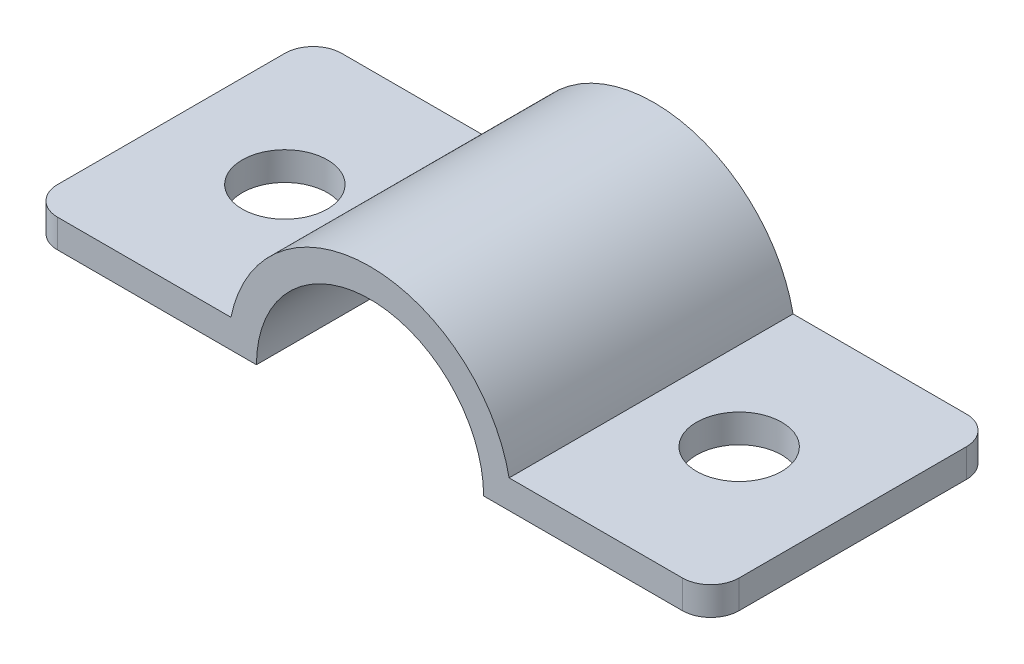
ISO-10303-21;
HEADER;
FILE_DESCRIPTION(('STEP AP214'),'2;1');
FILE_NAME('part.step','',(''),(''),'','','');
FILE_SCHEMA(('AUTOMOTIVE_DESIGN { 1 0 10303 214 1 1 1 1 }'));
ENDSEC;
DATA;
#1=APPLICATION_CONTEXT('core data for automotive mechanical design processes');
#2=APPLICATION_PROTOCOL_DEFINITION('international standard','automotive_design',2000,#1);
#3=PRODUCT_CONTEXT('',#1,'mechanical');
#4=PRODUCT('Part','Part','',(#3));
#5=PRODUCT_RELATED_PRODUCT_CATEGORY('part','',(#4));
#6=PRODUCT_DEFINITION_FORMATION('','',#4);
#7=PRODUCT_DEFINITION_CONTEXT('part definition',#1,'design');
#8=PRODUCT_DEFINITION('design','',#6,#7);
#9=PRODUCT_DEFINITION_SHAPE('','',#8);
#10=(LENGTH_UNIT() NAMED_UNIT(*) SI_UNIT(.MILLI.,.METRE.));
#11=(NAMED_UNIT(*) PLANE_ANGLE_UNIT() SI_UNIT($,.RADIAN.));
#12=(NAMED_UNIT(*) SI_UNIT($,.STERADIAN.) SOLID_ANGLE_UNIT());
#13=UNCERTAINTY_MEASURE_WITH_UNIT(LENGTH_MEASURE(1.E-05),#10,'distance_accuracy_value','');
#14=(GEOMETRIC_REPRESENTATION_CONTEXT(3) GLOBAL_UNCERTAINTY_ASSIGNED_CONTEXT((#13)) GLOBAL_UNIT_ASSIGNED_CONTEXT((#10,
#11,#12)) REPRESENTATION_CONTEXT('',''));
#15=CARTESIAN_POINT('',(0.,0.,0.));
#16=DIRECTION('',(0.,0.,1.));
#17=DIRECTION('',(1.,0.,0.));
#18=AXIS2_PLACEMENT_3D('',#15,#16,#17);
#19=CARTESIAN_POINT('',(0.,0.,5.));
#20=DIRECTION('',(0.,0.,-1.));
#21=DIRECTION('',(-1.,0.,0.));
#22=AXIS2_PLACEMENT_3D('',#19,#20,#21);
#23=CYLINDRICAL_SURFACE('',#22,5.);
#24=CARTESIAN_POINT('',(0.,0.,-5.));
#25=DIRECTION('',(0.,0.,1.));
#26=DIRECTION('',(1.,0.,0.));
#27=AXIS2_PLACEMENT_3D('',#24,#25,#26);
#28=CIRCLE('',#27,5.);
#29=CARTESIAN_POINT('',(4.89897948556636,1.,-5.));
#30=VERTEX_POINT('',#29);
#31=CARTESIAN_POINT('',(-4.89897948556636,1.,-5.));
#32=VERTEX_POINT('',#31);
#33=EDGE_CURVE('E159',#30,#32,#28,.T.);
#34=ORIENTED_EDGE('',*,*,#33,.T.);
#35=DIRECTION('',(0.,0.,-1.));
#36=VECTOR('',#35,1.);
#37=CARTESIAN_POINT('',(-4.89897948556636,1.,5.));
#38=LINE('',#37,#36);
#39=CARTESIAN_POINT('',(-4.89897948556636,1.,5.));
#40=VERTEX_POINT('',#39);
#41=EDGE_CURVE('E136',#40,#32,#38,.T.);
#42=ORIENTED_EDGE('',*,*,#41,.F.);
#43=CARTESIAN_POINT('',(0.,0.,5.));
#44=DIRECTION('',(0.,0.,1.));
#45=DIRECTION('',(1.,0.,0.));
#46=AXIS2_PLACEMENT_3D('',#43,#44,#45);
#47=CIRCLE('',#46,5.);
#48=CARTESIAN_POINT('',(4.89897948556636,1.,5.));
#49=VERTEX_POINT('',#48);
#50=EDGE_CURVE('E145',#49,#40,#47,.T.);
#51=ORIENTED_EDGE('',*,*,#50,.F.);
#52=DIRECTION('',(0.,0.,-1.));
#53=VECTOR('',#52,1.);
#54=CARTESIAN_POINT('',(4.89897948556636,1.,5.));
#55=LINE('',#54,#53);
#56=EDGE_CURVE('E233',#49,#30,#55,.T.);
#57=ORIENTED_EDGE('',*,*,#56,.T.);
#58=EDGE_LOOP('',(#34,#42,#51,#57));
#59=FACE_BOUND('',#58,.T.);
#60=ADVANCED_FACE('F39',(#59),#23,.T.);
#61=CARTESIAN_POINT('',(-4.89897948556636,1.,5.));
#62=DIRECTION('',(0.,-1.,0.));
#63=DIRECTION('',(1.,0.,0.));
#64=AXIS2_PLACEMENT_3D('',#61,#62,#63);
#65=PLANE('',#64);
#66=CARTESIAN_POINT('',(-8.,1.,0.));
#67=DIRECTION('',(0.,1.,0.));
#68=DIRECTION('',(0.,0.,1.));
#69=AXIS2_PLACEMENT_3D('',#66,#67,#68);
#70=CIRCLE('',#69,1.5);
#71=CARTESIAN_POINT('',(-8.,1.,1.5));
#72=VERTEX_POINT('',#71);
#73=EDGE_CURVE('E340',#72,#72,#70,.T.);
#74=ORIENTED_EDGE('',*,*,#73,.F.);
#75=EDGE_LOOP('',(#74));
#76=FACE_BOUND('',#75,.T.);
#77=DIRECTION('',(0.,0.,-1.));
#78=VECTOR('',#77,1.);
#79=CARTESIAN_POINT('',(-12.,0.999999999999999,5.));
#80=LINE('',#79,#78);
#81=CARTESIAN_POINT('',(-12.,0.999999999999999,4.));
#82=VERTEX_POINT('',#81);
#83=CARTESIAN_POINT('',(-12.,0.999999999999999,-4.));
#84=VERTEX_POINT('',#83);
#85=EDGE_CURVE('E162',#82,#84,#80,.T.);
#86=ORIENTED_EDGE('',*,*,#85,.F.);
#87=CARTESIAN_POINT('',(-11.,0.999999999999999,4.));
#88=DIRECTION('',(0.,-1.,0.));
#89=DIRECTION('',(1.,0.,0.));
#90=AXIS2_PLACEMENT_3D('',#87,#88,#89);
#91=CIRCLE('',#90,1.);
#92=CARTESIAN_POINT('',(-11.,0.999999999999999,5.));
#93=VERTEX_POINT('',#92);
#94=EDGE_CURVE('E139',#82,#93,#91,.F.);
#95=ORIENTED_EDGE('',*,*,#94,.T.);
#96=DIRECTION('',(-1.,0.,0.));
#97=VECTOR('',#96,1.);
#98=CARTESIAN_POINT('',(-4.89897948556636,1.,5.));
#99=LINE('',#98,#97);
#100=EDGE_CURVE('E130',#40,#93,#99,.T.);
#101=ORIENTED_EDGE('',*,*,#100,.F.);
#102=ORIENTED_EDGE('',*,*,#41,.T.);
#103=DIRECTION('',(-1.,0.,0.));
#104=VECTOR('',#103,1.);
#105=CARTESIAN_POINT('',(-4.89897948556636,1.,-5.));
#106=LINE('',#105,#104);
#107=CARTESIAN_POINT('',(-11.,0.999999999999999,-5.));
#108=VERTEX_POINT('',#107);
#109=EDGE_CURVE('E270',#32,#108,#106,.T.);
#110=ORIENTED_EDGE('',*,*,#109,.T.);
#111=CARTESIAN_POINT('',(-11.,0.999999999999999,-4.));
#112=DIRECTION('',(0.,-1.,0.));
#113=DIRECTION('',(1.,0.,0.));
#114=AXIS2_PLACEMENT_3D('',#111,#112,#113);
#115=CIRCLE('',#114,1.);
#116=EDGE_CURVE('E188',#108,#84,#115,.F.);
#117=ORIENTED_EDGE('',*,*,#116,.T.);
#118=EDGE_LOOP('',(#86,#95,#101,#102,#110,#117));
#119=FACE_BOUND('',#118,.T.);
#120=ADVANCED_FACE('F133',(#76,#119),#65,.F.);
#121=CARTESIAN_POINT('',(-12.,0.,5.));
#122=DIRECTION('',(1.,0.,0.));
#123=DIRECTION('',(0.,0.,-1.));
#124=AXIS2_PLACEMENT_3D('',#121,#122,#123);
#125=PLANE('',#124);
#126=DIRECTION('',(0.,0.,-1.));
#127=VECTOR('',#126,1.);
#128=CARTESIAN_POINT('',(-12.,0.,5.));
#129=LINE('',#128,#127);
#130=CARTESIAN_POINT('',(-12.,0.,4.));
#131=VERTEX_POINT('',#130);
#132=CARTESIAN_POINT('',(-12.,0.,-4.));
#133=VERTEX_POINT('',#132);
#134=EDGE_CURVE('E169',#131,#133,#129,.T.);
#135=ORIENTED_EDGE('',*,*,#134,.F.);
#136=DIRECTION('',(0.,-1.,0.));
#137=VECTOR('',#136,1.);
#138=CARTESIAN_POINT('',(-12.,0.999999999999999,4.));
#139=LINE('',#138,#137);
#140=EDGE_CURVE('E185',#131,#82,#139,.F.);
#141=ORIENTED_EDGE('',*,*,#140,.T.);
#142=ORIENTED_EDGE('',*,*,#85,.T.);
#143=DIRECTION('',(0.,-1.,0.));
#144=VECTOR('',#143,1.);
#145=CARTESIAN_POINT('',(-12.,0.,-4.));
#146=LINE('',#145,#144);
#147=EDGE_CURVE('E181',#84,#133,#146,.T.);
#148=ORIENTED_EDGE('',*,*,#147,.T.);
#149=EDGE_LOOP('',(#135,#141,#142,#148));
#150=FACE_BOUND('',#149,.T.);
#151=ADVANCED_FACE('F256',(#150),#125,.F.);
#152=CARTESIAN_POINT('',(-4.,0.,5.));
#153=DIRECTION('',(0.,1.,0.));
#154=DIRECTION('',(-1.,0.,0.));
#155=AXIS2_PLACEMENT_3D('',#152,#153,#154);
#156=PLANE('',#155);
#157=CARTESIAN_POINT('',(-8.,0.,0.));
#158=DIRECTION('',(0.,1.,0.));
#159=DIRECTION('',(-1.,0.,0.));
#160=AXIS2_PLACEMENT_3D('',#157,#158,#159);
#161=CIRCLE('',#160,1.5);
#162=CARTESIAN_POINT('',(-9.5,0.,0.));
#163=VERTEX_POINT('',#162);
#164=EDGE_CURVE('E43',#163,#163,#161,.T.);
#165=ORIENTED_EDGE('',*,*,#164,.T.);
#166=EDGE_LOOP('',(#165));
#167=FACE_BOUND('',#166,.T.);
#168=DIRECTION('',(1.,0.,0.));
#169=VECTOR('',#168,1.);
#170=CARTESIAN_POINT('',(-4.,0.,5.));
#171=LINE('',#170,#169);
#172=CARTESIAN_POINT('',(-11.,0.,5.));
#173=VERTEX_POINT('',#172);
#174=CARTESIAN_POINT('',(-4.,0.,5.));
#175=VERTEX_POINT('',#174);
#176=EDGE_CURVE('E144',#173,#175,#171,.T.);
#177=ORIENTED_EDGE('',*,*,#176,.F.);
#178=CARTESIAN_POINT('',(-11.,0.,4.));
#179=DIRECTION('',(0.,1.,0.));
#180=DIRECTION('',(-1.,0.,0.));
#181=AXIS2_PLACEMENT_3D('',#178,#179,#180);
#182=CIRCLE('',#181,1.);
#183=EDGE_CURVE('E178',#173,#131,#182,.F.);
#184=ORIENTED_EDGE('',*,*,#183,.T.);
#185=ORIENTED_EDGE('',*,*,#134,.T.);
#186=CARTESIAN_POINT('',(-11.,0.,-4.));
#187=DIRECTION('',(0.,1.,0.));
#188=DIRECTION('',(-1.,0.,0.));
#189=AXIS2_PLACEMENT_3D('',#186,#187,#188);
#190=CIRCLE('',#189,1.);
#191=CARTESIAN_POINT('',(-11.,0.,-5.));
#192=VERTEX_POINT('',#191);
#193=EDGE_CURVE('E175',#133,#192,#190,.F.);
#194=ORIENTED_EDGE('',*,*,#193,.T.);
#195=DIRECTION('',(1.,0.,0.));
#196=VECTOR('',#195,1.);
#197=CARTESIAN_POINT('',(-4.,0.,-5.));
#198=LINE('',#197,#196);
#199=CARTESIAN_POINT('',(-4.,0.,-5.));
#200=VERTEX_POINT('',#199);
#201=EDGE_CURVE('E273',#192,#200,#198,.T.);
#202=ORIENTED_EDGE('',*,*,#201,.T.);
#203=DIRECTION('',(0.,0.,-1.));
#204=VECTOR('',#203,1.);
#205=CARTESIAN_POINT('',(-4.,0.,5.));
#206=LINE('',#205,#204);
#207=EDGE_CURVE('E244',#175,#200,#206,.T.);
#208=ORIENTED_EDGE('',*,*,#207,.F.);
#209=EDGE_LOOP('',(#177,#184,#185,#194,#202,#208));
#210=FACE_BOUND('',#209,.T.);
#211=ADVANCED_FACE('F252',(#167,#210),#156,.F.);
#212=CARTESIAN_POINT('',(0.,0.,5.));
#213=DIRECTION('',(0.,0.,-1.));
#214=DIRECTION('',(-1.,0.,0.));
#215=AXIS2_PLACEMENT_3D('',#212,#213,#214);
#216=CYLINDRICAL_SURFACE('',#215,4.);
#217=CARTESIAN_POINT('',(0.,0.,-5.));
#218=DIRECTION('',(0.,0.,-1.));
#219=DIRECTION('',(1.,0.,0.));
#220=AXIS2_PLACEMENT_3D('',#217,#218,#219);
#221=CIRCLE('',#220,4.);
#222=CARTESIAN_POINT('',(4.,0.,-5.));
#223=VERTEX_POINT('',#222);
#224=EDGE_CURVE('E276',#200,#223,#221,.T.);
#225=ORIENTED_EDGE('',*,*,#224,.T.);
#226=DIRECTION('',(0.,0.,-1.));
#227=VECTOR('',#226,1.);
#228=CARTESIAN_POINT('',(4.,0.,5.));
#229=LINE('',#228,#227);
#230=CARTESIAN_POINT('',(4.,0.,5.));
#231=VERTEX_POINT('',#230);
#232=EDGE_CURVE('E237',#231,#223,#229,.T.);
#233=ORIENTED_EDGE('',*,*,#232,.F.);
#234=CARTESIAN_POINT('',(0.,0.,5.));
#235=DIRECTION('',(0.,0.,-1.));
#236=DIRECTION('',(1.,0.,0.));
#237=AXIS2_PLACEMENT_3D('',#234,#235,#236);
#238=CIRCLE('',#237,4.);
#239=EDGE_CURVE('E222',#175,#231,#238,.T.);
#240=ORIENTED_EDGE('',*,*,#239,.F.);
#241=ORIENTED_EDGE('',*,*,#207,.T.);
#242=EDGE_LOOP('',(#225,#233,#240,#241));
#243=FACE_BOUND('',#242,.T.);
#244=ADVANCED_FACE('F311',(#243),#216,.F.);
#245=CARTESIAN_POINT('',(4.,0.,5.));
#246=DIRECTION('',(0.,1.,0.));
#247=DIRECTION('',(-1.,0.,0.));
#248=AXIS2_PLACEMENT_3D('',#245,#246,#247);
#249=PLANE('',#248);
#250=CARTESIAN_POINT('',(8.,0.,0.));
#251=DIRECTION('',(0.,1.,0.));
#252=DIRECTION('',(-1.,0.,0.));
#253=AXIS2_PLACEMENT_3D('',#250,#251,#252);
#254=CIRCLE('',#253,1.5);
#255=CARTESIAN_POINT('',(6.5,0.,0.));
#256=VERTEX_POINT('',#255);
#257=EDGE_CURVE('E344',#256,#256,#254,.T.);
#258=ORIENTED_EDGE('',*,*,#257,.T.);
#259=EDGE_LOOP('',(#258));
#260=FACE_BOUND('',#259,.T.);
#261=DIRECTION('',(1.,0.,0.));
#262=VECTOR('',#261,1.);
#263=CARTESIAN_POINT('',(4.,0.,-5.));
#264=LINE('',#263,#262);
#265=CARTESIAN_POINT('',(11.,0.,-5.));
#266=VERTEX_POINT('',#265);
#267=EDGE_CURVE('E279',#223,#266,#264,.T.);
#268=ORIENTED_EDGE('',*,*,#267,.T.);
#269=CARTESIAN_POINT('',(11.,0.,-4.));
#270=DIRECTION('',(0.,1.,0.));
#271=DIRECTION('',(-1.,0.,0.));
#272=AXIS2_PLACEMENT_3D('',#269,#270,#271);
#273=CIRCLE('',#272,1.);
#274=CARTESIAN_POINT('',(12.,0.,-4.));
#275=VERTEX_POINT('',#274);
#276=EDGE_CURVE('E11',#266,#275,#273,.F.);
#277=ORIENTED_EDGE('',*,*,#276,.T.);
#278=DIRECTION('',(0.,0.,-1.));
#279=VECTOR('',#278,1.);
#280=CARTESIAN_POINT('',(12.,0.,5.));
#281=LINE('',#280,#279);
#282=CARTESIAN_POINT('',(12.,0.,4.));
#283=VERTEX_POINT('',#282);
#284=EDGE_CURVE('E218',#283,#275,#281,.T.);
#285=ORIENTED_EDGE('',*,*,#284,.F.);
#286=CARTESIAN_POINT('',(11.,0.,4.));
#287=DIRECTION('',(0.,1.,0.));
#288=DIRECTION('',(-1.,0.,0.));
#289=AXIS2_PLACEMENT_3D('',#286,#287,#288);
#290=CIRCLE('',#289,1.);
#291=CARTESIAN_POINT('',(11.,0.,5.));
#292=VERTEX_POINT('',#291);
#293=EDGE_CURVE('E49',#283,#292,#290,.F.);
#294=ORIENTED_EDGE('',*,*,#293,.T.);
#295=DIRECTION('',(1.,0.,0.));
#296=VECTOR('',#295,1.);
#297=CARTESIAN_POINT('',(4.,0.,5.));
#298=LINE('',#297,#296);
#299=EDGE_CURVE('E217',#231,#292,#298,.T.);
#300=ORIENTED_EDGE('',*,*,#299,.F.);
#301=ORIENTED_EDGE('',*,*,#232,.T.);
#302=EDGE_LOOP('',(#268,#277,#285,#294,#300,#301));
#303=FACE_BOUND('',#302,.T.);
#304=ADVANCED_FACE('F215',(#260,#303),#249,.F.);
#305=CARTESIAN_POINT('',(12.,0.,5.));
#306=DIRECTION('',(-1.,0.,0.));
#307=DIRECTION('',(0.,0.,1.));
#308=AXIS2_PLACEMENT_3D('',#305,#306,#307);
#309=PLANE('',#308);
#310=ORIENTED_EDGE('',*,*,#284,.T.);
#311=DIRECTION('',(0.,1.,0.));
#312=VECTOR('',#311,1.);
#313=CARTESIAN_POINT('',(12.,0.,-4.));
#314=LINE('',#313,#312);
#315=CARTESIAN_POINT('',(12.,1.,-4.));
#316=VERTEX_POINT('',#315);
#317=EDGE_CURVE('E201',#275,#316,#314,.T.);
#318=ORIENTED_EDGE('',*,*,#317,.T.);
#319=DIRECTION('',(0.,0.,-1.));
#320=VECTOR('',#319,1.);
#321=CARTESIAN_POINT('',(12.,1.,5.));
#322=LINE('',#321,#320);
#323=CARTESIAN_POINT('',(12.,1.,4.));
#324=VERTEX_POINT('',#323);
#325=EDGE_CURVE('E229',#324,#316,#322,.T.);
#326=ORIENTED_EDGE('',*,*,#325,.F.);
#327=DIRECTION('',(0.,1.,0.));
#328=VECTOR('',#327,1.);
#329=CARTESIAN_POINT('',(12.,0.,4.));
#330=LINE('',#329,#328);
#331=EDGE_CURVE('E61',#324,#283,#330,.F.);
#332=ORIENTED_EDGE('',*,*,#331,.T.);
#333=EDGE_LOOP('',(#310,#318,#326,#332));
#334=FACE_BOUND('',#333,.T.);
#335=ADVANCED_FACE('F230',(#334),#309,.F.);
#336=CARTESIAN_POINT('',(4.89897948556636,1.,5.));
#337=DIRECTION('',(0.,-1.,0.));
#338=DIRECTION('',(0.,0.,-1.));
#339=AXIS2_PLACEMENT_3D('',#336,#337,#338);
#340=PLANE('',#339);
#341=CARTESIAN_POINT('',(8.,1.,0.));
#342=DIRECTION('',(0.,1.,0.));
#343=DIRECTION('',(0.,0.,-1.));
#344=AXIS2_PLACEMENT_3D('',#341,#342,#343);
#345=CIRCLE('',#344,1.5);
#346=CARTESIAN_POINT('',(8.,1.,-1.5));
#347=VERTEX_POINT('',#346);
#348=EDGE_CURVE('E350',#347,#347,#345,.T.);
#349=ORIENTED_EDGE('',*,*,#348,.F.);
#350=EDGE_LOOP('',(#349));
#351=FACE_BOUND('',#350,.T.);
#352=ORIENTED_EDGE('',*,*,#325,.T.);
#353=CARTESIAN_POINT('',(11.,1.,-4.));
#354=DIRECTION('',(0.,-1.,0.));
#355=DIRECTION('',(0.,0.,-1.));
#356=AXIS2_PLACEMENT_3D('',#353,#354,#355);
#357=CIRCLE('',#356,1.);
#358=CARTESIAN_POINT('',(11.,1.,-5.));
#359=VERTEX_POINT('',#358);
#360=EDGE_CURVE('E208',#316,#359,#357,.F.);
#361=ORIENTED_EDGE('',*,*,#360,.T.);
#362=DIRECTION('',(-1.,0.,0.));
#363=VECTOR('',#362,1.);
#364=CARTESIAN_POINT('',(4.89897948556636,1.,-5.));
#365=LINE('',#364,#363);
#366=EDGE_CURVE('E156',#359,#30,#365,.T.);
#367=ORIENTED_EDGE('',*,*,#366,.T.);
#368=ORIENTED_EDGE('',*,*,#56,.F.);
#369=DIRECTION('',(-1.,0.,0.));
#370=VECTOR('',#369,1.);
#371=CARTESIAN_POINT('',(4.89897948556636,1.,5.));
#372=LINE('',#371,#370);
#373=CARTESIAN_POINT('',(11.,1.,5.));
#374=VERTEX_POINT('',#373);
#375=EDGE_CURVE('E151',#374,#49,#372,.T.);
#376=ORIENTED_EDGE('',*,*,#375,.F.);
#377=CARTESIAN_POINT('',(11.,1.,4.));
#378=DIRECTION('',(0.,-1.,0.));
#379=DIRECTION('',(0.,0.,-1.));
#380=AXIS2_PLACEMENT_3D('',#377,#378,#379);
#381=CIRCLE('',#380,1.);
#382=EDGE_CURVE('E205',#374,#324,#381,.F.);
#383=ORIENTED_EDGE('',*,*,#382,.T.);
#384=EDGE_LOOP('',(#352,#361,#367,#368,#376,#383));
#385=FACE_BOUND('',#384,.T.);
#386=ADVANCED_FACE('F228',(#351,#385),#340,.F.);
#387=CARTESIAN_POINT('',(0.,0.,5.));
#388=DIRECTION('',(0.,0.,1.));
#389=DIRECTION('',(1.,0.,0.));
#390=AXIS2_PLACEMENT_3D('',#387,#388,#389);
#391=PLANE('',#390);
#392=ORIENTED_EDGE('',*,*,#100,.T.);
#393=DIRECTION('',(0.,-1.,0.));
#394=VECTOR('',#393,1.);
#395=CARTESIAN_POINT('',(-11.,0.,5.));
#396=LINE('',#395,#394);
#397=EDGE_CURVE('E166',#93,#173,#396,.T.);
#398=ORIENTED_EDGE('',*,*,#397,.T.);
#399=ORIENTED_EDGE('',*,*,#176,.T.);
#400=ORIENTED_EDGE('',*,*,#239,.T.);
#401=ORIENTED_EDGE('',*,*,#299,.T.);
#402=DIRECTION('',(0.,1.,0.));
#403=VECTOR('',#402,1.);
#404=CARTESIAN_POINT('',(11.,1.,5.));
#405=LINE('',#404,#403);
#406=EDGE_CURVE('E161',#292,#374,#405,.T.);
#407=ORIENTED_EDGE('',*,*,#406,.T.);
#408=ORIENTED_EDGE('',*,*,#375,.T.);
#409=ORIENTED_EDGE('',*,*,#50,.T.);
#410=EDGE_LOOP('',(#392,#398,#399,#400,#401,#407,#408,#409));
#411=FACE_BOUND('',#410,.T.);
#412=ADVANCED_FACE('F148',(#411),#391,.T.);
#413=CARTESIAN_POINT('',(0.,0.,-5.));
#414=DIRECTION('',(0.,0.,1.));
#415=DIRECTION('',(1.,0.,0.));
#416=AXIS2_PLACEMENT_3D('',#413,#414,#415);
#417=PLANE('',#416);
#418=ORIENTED_EDGE('',*,*,#201,.F.);
#419=DIRECTION('',(0.,-1.,0.));
#420=VECTOR('',#419,1.);
#421=CARTESIAN_POINT('',(-11.,0.,-5.));
#422=LINE('',#421,#420);
#423=EDGE_CURVE('E196',#192,#108,#422,.F.);
#424=ORIENTED_EDGE('',*,*,#423,.T.);
#425=ORIENTED_EDGE('',*,*,#109,.F.);
#426=ORIENTED_EDGE('',*,*,#33,.F.);
#427=ORIENTED_EDGE('',*,*,#366,.F.);
#428=DIRECTION('',(0.,1.,0.));
#429=VECTOR('',#428,1.);
#430=CARTESIAN_POINT('',(11.,0.,-5.));
#431=LINE('',#430,#429);
#432=EDGE_CURVE('E193',#359,#266,#431,.F.);
#433=ORIENTED_EDGE('',*,*,#432,.T.);
#434=ORIENTED_EDGE('',*,*,#267,.F.);
#435=ORIENTED_EDGE('',*,*,#224,.F.);
#436=EDGE_LOOP('',(#418,#424,#425,#426,#427,#433,#434,#435));
#437=FACE_BOUND('',#436,.T.);
#438=ADVANCED_FACE('F285',(#437),#417,.F.);
#439=CARTESIAN_POINT('',(-11.,0.,4.));
#440=DIRECTION('',(0.,1.,0.));
#441=DIRECTION('',(0.,0.,1.));
#442=AXIS2_PLACEMENT_3D('',#439,#440,#441);
#443=CYLINDRICAL_SURFACE('',#442,1.);
#444=ORIENTED_EDGE('',*,*,#94,.F.);
#445=ORIENTED_EDGE('',*,*,#140,.F.);
#446=ORIENTED_EDGE('',*,*,#183,.F.);
#447=ORIENTED_EDGE('',*,*,#397,.F.);
#448=EDGE_LOOP('',(#444,#445,#446,#447));
#449=FACE_BOUND('',#448,.T.);
#450=ADVANCED_FACE('F259',(#449),#443,.T.);
#451=CARTESIAN_POINT('',(-11.,0.,-4.));
#452=DIRECTION('',(0.,-1.,0.));
#453=DIRECTION('',(0.,0.,-1.));
#454=AXIS2_PLACEMENT_3D('',#451,#452,#453);
#455=CYLINDRICAL_SURFACE('',#454,1.);
#456=ORIENTED_EDGE('',*,*,#116,.F.);
#457=ORIENTED_EDGE('',*,*,#423,.F.);
#458=ORIENTED_EDGE('',*,*,#193,.F.);
#459=ORIENTED_EDGE('',*,*,#147,.F.);
#460=EDGE_LOOP('',(#456,#457,#458,#459));
#461=FACE_BOUND('',#460,.T.);
#462=ADVANCED_FACE('F289',(#461),#455,.T.);
#463=CARTESIAN_POINT('',(11.,0.,-4.));
#464=DIRECTION('',(0.,1.,0.));
#465=DIRECTION('',(0.,0.,1.));
#466=AXIS2_PLACEMENT_3D('',#463,#464,#465);
#467=CYLINDRICAL_SURFACE('',#466,1.);
#468=ORIENTED_EDGE('',*,*,#276,.F.);
#469=ORIENTED_EDGE('',*,*,#432,.F.);
#470=ORIENTED_EDGE('',*,*,#360,.F.);
#471=ORIENTED_EDGE('',*,*,#317,.F.);
#472=EDGE_LOOP('',(#468,#469,#470,#471));
#473=FACE_BOUND('',#472,.T.);
#474=ADVANCED_FACE('F291',(#473),#467,.T.);
#475=CARTESIAN_POINT('',(11.,0.,4.));
#476=DIRECTION('',(0.,-1.,0.));
#477=DIRECTION('',(0.,0.,-1.));
#478=AXIS2_PLACEMENT_3D('',#475,#476,#477);
#479=CYLINDRICAL_SURFACE('',#478,1.);
#480=ORIENTED_EDGE('',*,*,#293,.F.);
#481=ORIENTED_EDGE('',*,*,#331,.F.);
#482=ORIENTED_EDGE('',*,*,#382,.F.);
#483=ORIENTED_EDGE('',*,*,#406,.F.);
#484=EDGE_LOOP('',(#480,#481,#482,#483));
#485=FACE_BOUND('',#484,.T.);
#486=ADVANCED_FACE('F41',(#485),#479,.T.);
#487=CARTESIAN_POINT('',(8.,-9.,0.));
#488=DIRECTION('',(0.,1.,0.));
#489=DIRECTION('',(0.,0.,1.));
#490=AXIS2_PLACEMENT_3D('',#487,#488,#489);
#491=CYLINDRICAL_SURFACE('',#490,1.5);
#492=ORIENTED_EDGE('',*,*,#348,.T.);
#493=EDGE_LOOP('',(#492));
#494=FACE_BOUND('',#493,.T.);
#495=ORIENTED_EDGE('',*,*,#257,.F.);
#496=EDGE_LOOP('',(#495));
#497=FACE_BOUND('',#496,.T.);
#498=ADVANCED_FACE('F328',(#494,#497),#491,.F.);
#499=CARTESIAN_POINT('',(-8.,-9.,0.));
#500=DIRECTION('',(0.,1.,0.));
#501=DIRECTION('',(0.,0.,1.));
#502=AXIS2_PLACEMENT_3D('',#499,#500,#501);
#503=CYLINDRICAL_SURFACE('',#502,1.5);
#504=ORIENTED_EDGE('',*,*,#73,.T.);
#505=EDGE_LOOP('',(#504));
#506=FACE_BOUND('',#505,.T.);
#507=ORIENTED_EDGE('',*,*,#164,.F.);
#508=EDGE_LOOP('',(#507));
#509=FACE_BOUND('',#508,.T.);
#510=ADVANCED_FACE('F331',(#506,#509),#503,.F.);
#511=CLOSED_SHELL('',(#60,#120,#151,#211,#244,#304,#335,#386,#412,#438,#450,#462,#474,#486,#498,#510));
#512=MANIFOLD_SOLID_BREP('B2',#511);
#513=ADVANCED_BREP_SHAPE_REPRESENTATION('',(#18,#512),#14);
#514=SHAPE_DEFINITION_REPRESENTATION(#9,#513);
ENDSEC;
END-ISO-10303-21;
